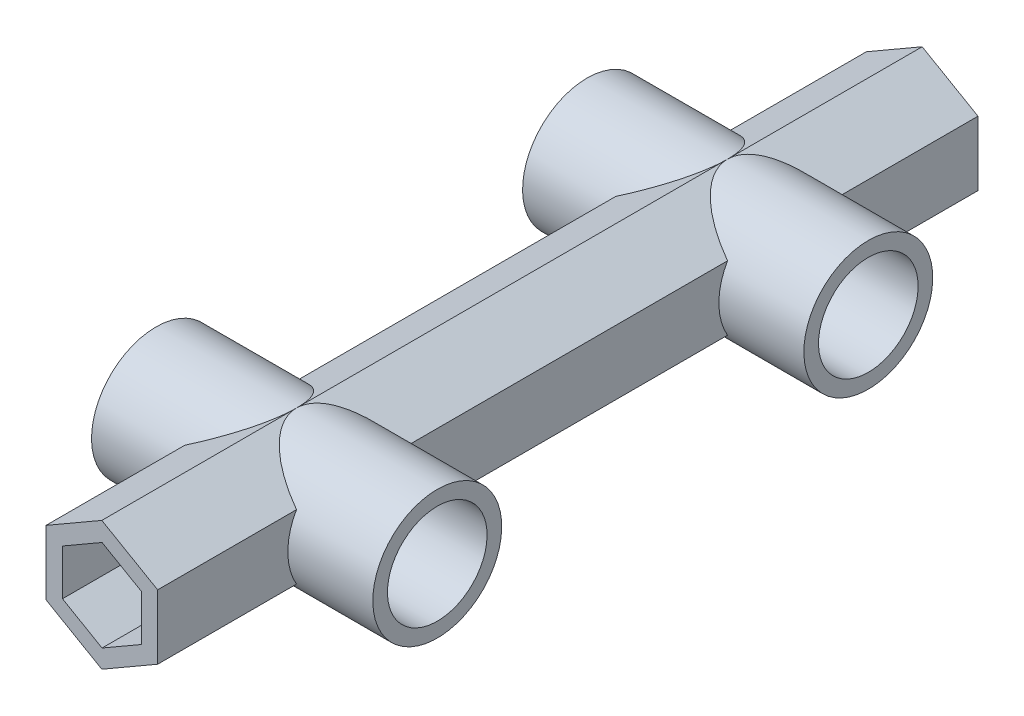
ISO-10303-21;
HEADER;
FILE_DESCRIPTION(('STEP AP214'),'2;1');
FILE_NAME('part.step','',(''),(''),'','','');
FILE_SCHEMA(('AUTOMOTIVE_DESIGN { 1 0 10303 214 1 1 1 1 }'));
ENDSEC;
DATA;
#1=APPLICATION_CONTEXT('core data for automotive mechanical design processes');
#2=APPLICATION_PROTOCOL_DEFINITION('international standard','automotive_design',2000,#1);
#3=PRODUCT_CONTEXT('',#1,'mechanical');
#4=PRODUCT('Part','Part','',(#3));
#5=PRODUCT_RELATED_PRODUCT_CATEGORY('part','',(#4));
#6=PRODUCT_DEFINITION_FORMATION('','',#4);
#7=PRODUCT_DEFINITION_CONTEXT('part definition',#1,'design');
#8=PRODUCT_DEFINITION('design','',#6,#7);
#9=PRODUCT_DEFINITION_SHAPE('','',#8);
#10=(LENGTH_UNIT() NAMED_UNIT(*) SI_UNIT(.MILLI.,.METRE.));
#11=(NAMED_UNIT(*) PLANE_ANGLE_UNIT() SI_UNIT($,.RADIAN.));
#12=(NAMED_UNIT(*) SI_UNIT($,.STERADIAN.) SOLID_ANGLE_UNIT());
#13=UNCERTAINTY_MEASURE_WITH_UNIT(LENGTH_MEASURE(1.E-05),#10,'distance_accuracy_value','');
#14=(GEOMETRIC_REPRESENTATION_CONTEXT(3) GLOBAL_UNCERTAINTY_ASSIGNED_CONTEXT((#13)) GLOBAL_UNIT_ASSIGNED_CONTEXT((#10,
#11,#12)) REPRESENTATION_CONTEXT('',''));
#15=CARTESIAN_POINT('',(0.,0.,0.));
#16=DIRECTION('',(0.,0.,1.));
#17=DIRECTION('',(1.,0.,0.));
#18=AXIS2_PLACEMENT_3D('',#15,#16,#17);
#19=CARTESIAN_POINT('',(-9.52627944162882,0.,70.));
#20=DIRECTION('',(1.,0.,0.));
#21=DIRECTION('',(0.,1.,0.));
#22=AXIS2_PLACEMENT_3D('',#19,#20,#21);
#23=PLANE('',#22);
#24=DIRECTION('',(0.,0.,-1.));
#25=VECTOR('',#24,1.);
#26=CARTESIAN_POINT('',(-9.52627944162882,5.5,70.));
#27=LINE('',#26,#25);
#28=CARTESIAN_POINT('',(-9.52627944162882,5.5,27.2537205583712));
#29=VERTEX_POINT('',#28);
#30=CARTESIAN_POINT('',(-9.52627944162882,5.5,-27.2537205583712));
#31=VERTEX_POINT('',#30);
#32=EDGE_CURVE('E262',#29,#31,#27,.T.);
#33=ORIENTED_EDGE('',*,*,#32,.T.);
#34=CARTESIAN_POINT('',(-9.52627944162882,0.,-36.78));
#35=DIRECTION('',(1.,0.,0.));
#36=DIRECTION('',(0.,1.,0.));
#37=AXIS2_PLACEMENT_3D('',#34,#35,#36);
#38=CIRCLE('',#37,11.);
#39=CARTESIAN_POINT('',(-9.52627944162882,-5.5,-27.2537205583712));
#40=VERTEX_POINT('',#39);
#41=EDGE_CURVE('E248',#31,#40,#38,.T.);
#42=ORIENTED_EDGE('',*,*,#41,.T.);
#43=DIRECTION('',(0.,0.,-1.));
#44=VECTOR('',#43,1.);
#45=CARTESIAN_POINT('',(-9.52627944162882,-5.5,70.));
#46=LINE('',#45,#44);
#47=CARTESIAN_POINT('',(-9.52627944162882,-5.5,27.2537205583712));
#48=VERTEX_POINT('',#47);
#49=EDGE_CURVE('E260',#48,#40,#46,.T.);
#50=ORIENTED_EDGE('',*,*,#49,.F.);
#51=CARTESIAN_POINT('',(-9.52627944162882,0.,36.78));
#52=DIRECTION('',(1.,0.,0.));
#53=DIRECTION('',(0.,1.,0.));
#54=AXIS2_PLACEMENT_3D('',#51,#52,#53);
#55=CIRCLE('',#54,11.);
#56=EDGE_CURVE('E277',#48,#29,#55,.T.);
#57=ORIENTED_EDGE('',*,*,#56,.T.);
#58=EDGE_LOOP('',(#33,#42,#50,#57));
#59=FACE_BOUND('',#58,.T.);
#60=ADVANCED_FACE('F62',(#59),#23,.F.);
#61=CARTESIAN_POINT('',(-4.76313972081441,8.25,70.));
#62=DIRECTION('',(0.5,-0.866025403784439,0.));
#63=DIRECTION('',(0.866025403784439,0.5,0.));
#64=AXIS2_PLACEMENT_3D('',#61,#62,#63);
#65=PLANE('',#64);
#66=DIRECTION('',(0.,0.,-1.));
#67=VECTOR('',#66,1.);
#68=CARTESIAN_POINT('',(0.,11.,70.));
#69=LINE('',#68,#67);
#70=CARTESIAN_POINT('',(0.,11.,36.78));
#71=VERTEX_POINT('',#70);
#72=CARTESIAN_POINT('',(0.,11.,-36.78));
#73=VERTEX_POINT('',#72);
#74=EDGE_CURVE('E360',#71,#73,#69,.T.);
#75=ORIENTED_EDGE('',*,*,#74,.T.);
#76=CARTESIAN_POINT('',(-19.0525588832577,0.,-36.78));
#77=DIRECTION('',(0.5,-0.866025403784439,0.));
#78=DIRECTION('',(0.866025403784439,0.5,0.));
#79=AXIS2_PLACEMENT_3D('',#76,#77,#78);
#80=ELLIPSE('',#79,22.,11.);
#81=EDGE_CURVE('E435',#73,#31,#80,.T.);
#82=ORIENTED_EDGE('',*,*,#81,.T.);
#83=ORIENTED_EDGE('',*,*,#32,.F.);
#84=CARTESIAN_POINT('',(-19.0525588832577,0.,36.78));
#85=DIRECTION('',(0.5,-0.866025403784439,0.));
#86=DIRECTION('',(0.866025403784439,0.5,0.));
#87=AXIS2_PLACEMENT_3D('',#84,#85,#86);
#88=ELLIPSE('',#87,22.,11.);
#89=EDGE_CURVE('E517',#29,#71,#88,.T.);
#90=ORIENTED_EDGE('',*,*,#89,.T.);
#91=EDGE_LOOP('',(#75,#82,#83,#90));
#92=FACE_BOUND('',#91,.T.);
#93=ADVANCED_FACE('F497',(#92),#65,.F.);
#94=CARTESIAN_POINT('',(4.76313972081441,8.25,70.));
#95=DIRECTION('',(-0.5,-0.866025403784439,0.));
#96=DIRECTION('',(0.866025403784439,-0.5,0.));
#97=AXIS2_PLACEMENT_3D('',#94,#95,#96);
#98=PLANE('',#97);
#99=DIRECTION('',(0.,0.,-1.));
#100=VECTOR('',#99,1.);
#101=CARTESIAN_POINT('',(9.52627944162882,5.5,70.));
#102=LINE('',#101,#100);
#103=CARTESIAN_POINT('',(9.52627944162882,5.5,27.2537205583712));
#104=VERTEX_POINT('',#103);
#105=CARTESIAN_POINT('',(9.52627944162882,5.5,-27.2537205583712));
#106=VERTEX_POINT('',#105);
#107=EDGE_CURVE('E365',#104,#106,#102,.T.);
#108=ORIENTED_EDGE('',*,*,#107,.T.);
#109=CARTESIAN_POINT('',(19.0525588832576,0.,-36.78));
#110=DIRECTION('',(-0.5,-0.866025403784439,0.));
#111=DIRECTION('',(0.866025403784439,-0.5,0.));
#112=AXIS2_PLACEMENT_3D('',#109,#110,#111);
#113=ELLIPSE('',#112,22.,11.);
#114=EDGE_CURVE('E413',#106,#73,#113,.T.);
#115=ORIENTED_EDGE('',*,*,#114,.T.);
#116=ORIENTED_EDGE('',*,*,#74,.F.);
#117=CARTESIAN_POINT('',(19.0525588832576,0.,36.78));
#118=DIRECTION('',(-0.5,-0.866025403784439,0.));
#119=DIRECTION('',(0.866025403784439,-0.5,0.));
#120=AXIS2_PLACEMENT_3D('',#117,#118,#119);
#121=ELLIPSE('',#120,22.,11.);
#122=EDGE_CURVE('E416',#71,#104,#121,.T.);
#123=ORIENTED_EDGE('',*,*,#122,.T.);
#124=EDGE_LOOP('',(#108,#115,#116,#123));
#125=FACE_BOUND('',#124,.T.);
#126=ADVANCED_FACE('F411',(#125),#98,.F.);
#127=CARTESIAN_POINT('',(9.52627944162882,0.,70.));
#128=DIRECTION('',(-1.,0.,0.));
#129=DIRECTION('',(0.,-1.,0.));
#130=AXIS2_PLACEMENT_3D('',#127,#128,#129);
#131=PLANE('',#130);
#132=DIRECTION('',(0.,0.,-1.));
#133=VECTOR('',#132,1.);
#134=CARTESIAN_POINT('',(9.52627944162883,-5.5,70.));
#135=LINE('',#134,#133);
#136=CARTESIAN_POINT('',(9.52627944162883,-5.5,27.2537205583712));
#137=VERTEX_POINT('',#136);
#138=CARTESIAN_POINT('',(9.52627944162883,-5.5,-27.2537205583712));
#139=VERTEX_POINT('',#138);
#140=EDGE_CURVE('E370',#137,#139,#135,.T.);
#141=ORIENTED_EDGE('',*,*,#140,.T.);
#142=CARTESIAN_POINT('',(9.52627944162882,0.,-36.78));
#143=DIRECTION('',(-1.,0.,0.));
#144=DIRECTION('',(0.,-1.,0.));
#145=AXIS2_PLACEMENT_3D('',#142,#143,#144);
#146=CIRCLE('',#145,11.);
#147=EDGE_CURVE('E423',#139,#106,#146,.T.);
#148=ORIENTED_EDGE('',*,*,#147,.T.);
#149=ORIENTED_EDGE('',*,*,#107,.F.);
#150=CARTESIAN_POINT('',(9.52627944162882,0.,36.78));
#151=DIRECTION('',(-1.,0.,0.));
#152=DIRECTION('',(0.,-1.,0.));
#153=AXIS2_PLACEMENT_3D('',#150,#151,#152);
#154=CIRCLE('',#153,11.);
#155=EDGE_CURVE('E421',#104,#137,#154,.T.);
#156=ORIENTED_EDGE('',*,*,#155,.T.);
#157=EDGE_LOOP('',(#141,#148,#149,#156));
#158=FACE_BOUND('',#157,.T.);
#159=ADVANCED_FACE('F420',(#158),#131,.F.);
#160=CARTESIAN_POINT('',(9.52627944162883,-5.5,70.));
#161=VERTEX_POINT('',#160);
#162=CARTESIAN_POINT('',(9.52627944162883,-5.5,46.3062794416288));
#163=VERTEX_POINT('',#162);
#164=EDGE_CURVE('E366',#161,#163,#135,.T.);
#165=ORIENTED_EDGE('',*,*,#164,.T.);
#166=CARTESIAN_POINT('',(9.52627944162882,5.5,46.3062794416288));
#167=VERTEX_POINT('',#166);
#168=EDGE_CURVE('E538',#163,#167,#154,.T.);
#169=ORIENTED_EDGE('',*,*,#168,.T.);
#170=CARTESIAN_POINT('',(9.52627944162882,5.5,70.));
#171=VERTEX_POINT('',#170);
#172=EDGE_CURVE('E361',#171,#167,#102,.T.);
#173=ORIENTED_EDGE('',*,*,#172,.F.);
#174=DIRECTION('',(0.,1.,0.));
#175=VECTOR('',#174,1.);
#176=CARTESIAN_POINT('',(9.52627944162882,0.,70.));
#177=LINE('',#176,#175);
#178=EDGE_CURVE('E323',#161,#171,#177,.T.);
#179=ORIENTED_EDGE('',*,*,#178,.F.);
#180=EDGE_LOOP('',(#165,#169,#173,#179));
#181=FACE_BOUND('',#180,.T.);
#182=ADVANCED_FACE('F708',(#181),#131,.F.);
#183=ORIENTED_EDGE('',*,*,#172,.T.);
#184=EDGE_CURVE('E528',#167,#71,#121,.T.);
#185=ORIENTED_EDGE('',*,*,#184,.T.);
#186=CARTESIAN_POINT('',(0.,11.,70.));
#187=VERTEX_POINT('',#186);
#188=EDGE_CURVE('E355',#187,#71,#69,.T.);
#189=ORIENTED_EDGE('',*,*,#188,.F.);
#190=DIRECTION('',(-0.866025403784439,0.5,0.));
#191=VECTOR('',#190,1.);
#192=CARTESIAN_POINT('',(4.76313972081441,8.25,70.));
#193=LINE('',#192,#191);
#194=EDGE_CURVE('E326',#171,#187,#193,.T.);
#195=ORIENTED_EDGE('',*,*,#194,.F.);
#196=EDGE_LOOP('',(#183,#185,#189,#195));
#197=FACE_BOUND('',#196,.T.);
#198=ADVANCED_FACE('F529',(#197),#98,.F.);
#199=ORIENTED_EDGE('',*,*,#188,.T.);
#200=CARTESIAN_POINT('',(-9.52627944162882,5.5,46.3062794416288));
#201=VERTEX_POINT('',#200);
#202=EDGE_CURVE('E525',#71,#201,#88,.T.);
#203=ORIENTED_EDGE('',*,*,#202,.T.);
#204=CARTESIAN_POINT('',(-9.52627944162882,5.5,70.));
#205=VERTEX_POINT('',#204);
#206=EDGE_CURVE('E290',#205,#201,#27,.T.);
#207=ORIENTED_EDGE('',*,*,#206,.F.);
#208=DIRECTION('',(-0.866025403784439,-0.5,0.));
#209=VECTOR('',#208,1.);
#210=CARTESIAN_POINT('',(-4.76313972081441,8.25,70.));
#211=LINE('',#210,#209);
#212=EDGE_CURVE('E309',#187,#205,#211,.T.);
#213=ORIENTED_EDGE('',*,*,#212,.F.);
#214=EDGE_LOOP('',(#199,#203,#207,#213));
#215=FACE_BOUND('',#214,.T.);
#216=ADVANCED_FACE('F503',(#215),#65,.F.);
#217=ORIENTED_EDGE('',*,*,#206,.T.);
#218=CARTESIAN_POINT('',(-9.52627944162882,-5.5,46.3062794416288));
#219=VERTEX_POINT('',#218);
#220=EDGE_CURVE('E255',#201,#219,#55,.T.);
#221=ORIENTED_EDGE('',*,*,#220,.T.);
#222=CARTESIAN_POINT('',(-9.52627944162882,-5.5,70.));
#223=VERTEX_POINT('',#222);
#224=EDGE_CURVE('E271',#223,#219,#46,.T.);
#225=ORIENTED_EDGE('',*,*,#224,.F.);
#226=DIRECTION('',(0.,-1.,0.));
#227=VECTOR('',#226,1.);
#228=CARTESIAN_POINT('',(-9.52627944162882,0.,70.));
#229=LINE('',#228,#227);
#230=EDGE_CURVE('E305',#205,#223,#229,.T.);
#231=ORIENTED_EDGE('',*,*,#230,.F.);
#232=EDGE_LOOP('',(#217,#221,#225,#231));
#233=FACE_BOUND('',#232,.T.);
#234=ADVANCED_FACE('F287',(#233),#23,.F.);
#235=CARTESIAN_POINT('',(-4.76313972081441,-8.25,70.));
#236=DIRECTION('',(0.5,0.866025403784439,0.));
#237=DIRECTION('',(-0.866025403784439,0.5,0.));
#238=AXIS2_PLACEMENT_3D('',#235,#236,#237);
#239=PLANE('',#238);
#240=ORIENTED_EDGE('',*,*,#224,.T.);
#241=CARTESIAN_POINT('',(-19.0525588832576,0.,36.78));
#242=DIRECTION('',(0.5,0.866025403784439,0.));
#243=DIRECTION('',(0.866025403784439,-0.5,0.));
#244=AXIS2_PLACEMENT_3D('',#241,#242,#243);
#245=ELLIPSE('',#244,22.,11.);
#246=CARTESIAN_POINT('',(0.,-11.,36.78));
#247=VERTEX_POINT('',#246);
#248=EDGE_CURVE('E297',#219,#247,#245,.T.);
#249=ORIENTED_EDGE('',*,*,#248,.T.);
#250=DIRECTION('',(0.,0.,-1.));
#251=VECTOR('',#250,1.);
#252=CARTESIAN_POINT('',(0.,-11.,70.));
#253=LINE('',#252,#251);
#254=CARTESIAN_POINT('',(0.,-11.,70.));
#255=VERTEX_POINT('',#254);
#256=EDGE_CURVE('E278',#255,#247,#253,.T.);
#257=ORIENTED_EDGE('',*,*,#256,.F.);
#258=DIRECTION('',(0.866025403784439,-0.5,0.));
#259=VECTOR('',#258,1.);
#260=CARTESIAN_POINT('',(-4.76313972081441,-8.25,70.));
#261=LINE('',#260,#259);
#262=EDGE_CURVE('E298',#223,#255,#261,.T.);
#263=ORIENTED_EDGE('',*,*,#262,.F.);
#264=EDGE_LOOP('',(#240,#249,#257,#263));
#265=FACE_BOUND('',#264,.T.);
#266=ADVANCED_FACE('F295',(#265),#239,.F.);
#267=CARTESIAN_POINT('',(4.76313972081441,-8.25,70.));
#268=DIRECTION('',(-0.5,0.866025403784439,0.));
#269=DIRECTION('',(-0.866025403784439,-0.5,0.));
#270=AXIS2_PLACEMENT_3D('',#267,#268,#269);
#271=PLANE('',#270);
#272=ORIENTED_EDGE('',*,*,#256,.T.);
#273=CARTESIAN_POINT('',(19.0525588832577,0.,36.78));
#274=DIRECTION('',(-0.5,0.866025403784439,0.));
#275=DIRECTION('',(0.866025403784439,0.5,0.));
#276=AXIS2_PLACEMENT_3D('',#273,#274,#275);
#277=ELLIPSE('',#276,22.,11.);
#278=EDGE_CURVE('E541',#247,#163,#277,.T.);
#279=ORIENTED_EDGE('',*,*,#278,.T.);
#280=ORIENTED_EDGE('',*,*,#164,.F.);
#281=DIRECTION('',(0.866025403784439,0.5,0.));
#282=VECTOR('',#281,1.);
#283=CARTESIAN_POINT('',(4.76313972081441,-8.25,70.));
#284=LINE('',#283,#282);
#285=EDGE_CURVE('E304',#255,#161,#284,.T.);
#286=ORIENTED_EDGE('',*,*,#285,.F.);
#287=EDGE_LOOP('',(#272,#279,#280,#286));
#288=FACE_BOUND('',#287,.T.);
#289=ADVANCED_FACE('F699',(#288),#271,.F.);
#290=CARTESIAN_POINT('',(0.,0.,70.));
#291=DIRECTION('',(0.,0.,1.));
#292=DIRECTION('',(1.,0.,0.));
#293=AXIS2_PLACEMENT_3D('',#290,#291,#292);
#294=PLANE('',#293);
#295=DIRECTION('',(0.866025403784439,-0.5,0.));
#296=VECTOR('',#295,1.);
#297=CARTESIAN_POINT('',(-6.71421235470221,-3.94078579481641,70.));
#298=LINE('',#297,#296);
#299=CARTESIAN_POINT('',(-6.71421235470221,-3.94078579481641,70.));
#300=VERTEX_POINT('',#299);
#301=CARTESIAN_POINT('',(0.0407857948164104,-7.84078579481641,70.));
#302=VERTEX_POINT('',#301);
#303=EDGE_CURVE('E578',#300,#302,#298,.T.);
#304=ORIENTED_EDGE('',*,*,#303,.F.);
#305=DIRECTION('',(0.,-1.,0.));
#306=VECTOR('',#305,1.);
#307=CARTESIAN_POINT('',(-6.71421235470221,3.85921420518359,70.));
#308=LINE('',#307,#306);
#309=CARTESIAN_POINT('',(-6.71421235470221,3.85921420518359,70.));
#310=VERTEX_POINT('',#309);
#311=EDGE_CURVE('E599',#310,#300,#308,.T.);
#312=ORIENTED_EDGE('',*,*,#311,.F.);
#313=DIRECTION('',(-0.866025403784439,-0.5,0.));
#314=VECTOR('',#313,1.);
#315=CARTESIAN_POINT('',(0.0407857948164078,7.75921420518359,70.));
#316=LINE('',#315,#314);
#317=CARTESIAN_POINT('',(0.0407857948164078,7.75921420518359,70.));
#318=VERTEX_POINT('',#317);
#319=EDGE_CURVE('E633',#318,#310,#316,.T.);
#320=ORIENTED_EDGE('',*,*,#319,.F.);
#321=DIRECTION('',(-0.866025403784439,0.5,0.));
#322=VECTOR('',#321,1.);
#323=CARTESIAN_POINT('',(6.79578394433503,3.85921420518359,70.));
#324=LINE('',#323,#322);
#325=CARTESIAN_POINT('',(6.79578394433503,3.85921420518359,70.));
#326=VERTEX_POINT('',#325);
#327=EDGE_CURVE('E629',#326,#318,#324,.T.);
#328=ORIENTED_EDGE('',*,*,#327,.F.);
#329=DIRECTION('',(0.,1.,0.));
#330=VECTOR('',#329,1.);
#331=CARTESIAN_POINT('',(6.79578394433503,-3.94078579481641,70.));
#332=LINE('',#331,#330);
#333=CARTESIAN_POINT('',(6.79578394433503,-3.94078579481641,70.));
#334=VERTEX_POINT('',#333);
#335=EDGE_CURVE('E625',#334,#326,#332,.T.);
#336=ORIENTED_EDGE('',*,*,#335,.F.);
#337=DIRECTION('',(0.866025403784439,0.5,0.));
#338=VECTOR('',#337,1.);
#339=CARTESIAN_POINT('',(0.0407857948164104,-7.84078579481641,70.));
#340=LINE('',#339,#338);
#341=EDGE_CURVE('E621',#302,#334,#340,.T.);
#342=ORIENTED_EDGE('',*,*,#341,.F.);
#343=EDGE_LOOP('',(#304,#312,#320,#328,#336,#342));
#344=FACE_BOUND('',#343,.T.);
#345=ORIENTED_EDGE('',*,*,#230,.T.);
#346=ORIENTED_EDGE('',*,*,#262,.T.);
#347=ORIENTED_EDGE('',*,*,#285,.T.);
#348=ORIENTED_EDGE('',*,*,#178,.T.);
#349=ORIENTED_EDGE('',*,*,#194,.T.);
#350=ORIENTED_EDGE('',*,*,#212,.T.);
#351=EDGE_LOOP('',(#345,#346,#347,#348,#349,#350));
#352=FACE_BOUND('',#351,.T.);
#353=ADVANCED_FACE('F307',(#344,#352),#294,.T.);
#354=CARTESIAN_POINT('',(-6.71421235470221,-3.94078579481641,55.));
#355=DIRECTION('',(-0.5,-0.866025403784439,0.));
#356=DIRECTION('',(0.866025403784439,-0.5,0.));
#357=AXIS2_PLACEMENT_3D('',#354,#355,#356);
#358=PLANE('',#357);
#359=ORIENTED_EDGE('',*,*,#303,.T.);
#360=DIRECTION('',(0.,0.,1.));
#361=VECTOR('',#360,1.);
#362=CARTESIAN_POINT('',(0.0407857948164104,-7.84078579481641,55.));
#363=LINE('',#362,#361);
#364=CARTESIAN_POINT('',(0.0407857948164104,-7.84078579481641,55.));
#365=VERTEX_POINT('',#364);
#366=EDGE_CURVE('E318',#365,#302,#363,.T.);
#367=ORIENTED_EDGE('',*,*,#366,.F.);
#368=DIRECTION('',(0.866025403784439,-0.5,0.));
#369=VECTOR('',#368,1.);
#370=CARTESIAN_POINT('',(-6.71421235470221,-3.94078579481641,55.));
#371=LINE('',#370,#369);
#372=CARTESIAN_POINT('',(-6.71421235470221,-3.94078579481641,55.));
#373=VERTEX_POINT('',#372);
#374=EDGE_CURVE('E594',#373,#365,#371,.T.);
#375=ORIENTED_EDGE('',*,*,#374,.F.);
#376=DIRECTION('',(0.,0.,1.));
#377=VECTOR('',#376,1.);
#378=CARTESIAN_POINT('',(-6.71421235470221,-3.94078579481641,55.));
#379=LINE('',#378,#377);
#380=EDGE_CURVE('E337',#373,#300,#379,.T.);
#381=ORIENTED_EDGE('',*,*,#380,.T.);
#382=EDGE_LOOP('',(#359,#367,#375,#381));
#383=FACE_BOUND('',#382,.T.);
#384=ADVANCED_FACE('F676',(#383),#358,.F.);
#385=CARTESIAN_POINT('',(-6.71421235470221,3.85921420518359,55.));
#386=DIRECTION('',(-1.,0.,0.));
#387=DIRECTION('',(0.,-1.,0.));
#388=AXIS2_PLACEMENT_3D('',#385,#386,#387);
#389=PLANE('',#388);
#390=ORIENTED_EDGE('',*,*,#311,.T.);
#391=ORIENTED_EDGE('',*,*,#380,.F.);
#392=DIRECTION('',(0.,-1.,0.));
#393=VECTOR('',#392,1.);
#394=CARTESIAN_POINT('',(-6.71421235470221,3.85921420518359,55.));
#395=LINE('',#394,#393);
#396=CARTESIAN_POINT('',(-6.71421235470221,3.85921420518359,55.));
#397=VERTEX_POINT('',#396);
#398=EDGE_CURVE('E615',#397,#373,#395,.T.);
#399=ORIENTED_EDGE('',*,*,#398,.F.);
#400=DIRECTION('',(0.,0.,1.));
#401=VECTOR('',#400,1.);
#402=CARTESIAN_POINT('',(-6.71421235470221,3.85921420518359,55.));
#403=LINE('',#402,#401);
#404=EDGE_CURVE('E642',#397,#310,#403,.T.);
#405=ORIENTED_EDGE('',*,*,#404,.T.);
#406=EDGE_LOOP('',(#390,#391,#399,#405));
#407=FACE_BOUND('',#406,.T.);
#408=ADVANCED_FACE('F678',(#407),#389,.F.);
#409=CARTESIAN_POINT('',(0.0407857948164078,7.75921420518359,55.));
#410=DIRECTION('',(-0.5,0.866025403784439,0.));
#411=DIRECTION('',(-0.866025403784439,-0.5,0.));
#412=AXIS2_PLACEMENT_3D('',#409,#410,#411);
#413=PLANE('',#412);
#414=ORIENTED_EDGE('',*,*,#319,.T.);
#415=ORIENTED_EDGE('',*,*,#404,.F.);
#416=DIRECTION('',(-0.866025403784439,-0.5,0.));
#417=VECTOR('',#416,1.);
#418=CARTESIAN_POINT('',(0.0407857948164078,7.75921420518359,55.));
#419=LINE('',#418,#417);
#420=CARTESIAN_POINT('',(0.0407857948164078,7.75921420518359,55.));
#421=VERTEX_POINT('',#420);
#422=EDGE_CURVE('E611',#421,#397,#419,.T.);
#423=ORIENTED_EDGE('',*,*,#422,.F.);
#424=DIRECTION('',(0.,0.,1.));
#425=VECTOR('',#424,1.);
#426=CARTESIAN_POINT('',(0.0407857948164078,7.75921420518359,55.));
#427=LINE('',#426,#425);
#428=EDGE_CURVE('E645',#421,#318,#427,.T.);
#429=ORIENTED_EDGE('',*,*,#428,.T.);
#430=EDGE_LOOP('',(#414,#415,#423,#429));
#431=FACE_BOUND('',#430,.T.);
#432=ADVANCED_FACE('F680',(#431),#413,.F.);
#433=CARTESIAN_POINT('',(6.79578394433503,3.85921420518359,55.));
#434=DIRECTION('',(0.5,0.866025403784439,0.));
#435=DIRECTION('',(-0.866025403784439,0.5,0.));
#436=AXIS2_PLACEMENT_3D('',#433,#434,#435);
#437=PLANE('',#436);
#438=ORIENTED_EDGE('',*,*,#327,.T.);
#439=ORIENTED_EDGE('',*,*,#428,.F.);
#440=DIRECTION('',(-0.866025403784439,0.5,0.));
#441=VECTOR('',#440,1.);
#442=CARTESIAN_POINT('',(6.79578394433503,3.85921420518359,55.));
#443=LINE('',#442,#441);
#444=CARTESIAN_POINT('',(6.79578394433503,3.85921420518359,55.));
#445=VERTEX_POINT('',#444);
#446=EDGE_CURVE('E607',#445,#421,#443,.T.);
#447=ORIENTED_EDGE('',*,*,#446,.F.);
#448=DIRECTION('',(0.,0.,1.));
#449=VECTOR('',#448,1.);
#450=CARTESIAN_POINT('',(6.79578394433503,3.85921420518359,55.));
#451=LINE('',#450,#449);
#452=EDGE_CURVE('E648',#445,#326,#451,.T.);
#453=ORIENTED_EDGE('',*,*,#452,.T.);
#454=EDGE_LOOP('',(#438,#439,#447,#453));
#455=FACE_BOUND('',#454,.T.);
#456=ADVANCED_FACE('F671',(#455),#437,.F.);
#457=CARTESIAN_POINT('',(6.79578394433503,-3.94078579481641,55.));
#458=DIRECTION('',(1.,0.,0.));
#459=DIRECTION('',(0.,1.,0.));
#460=AXIS2_PLACEMENT_3D('',#457,#458,#459);
#461=PLANE('',#460);
#462=ORIENTED_EDGE('',*,*,#335,.T.);
#463=ORIENTED_EDGE('',*,*,#452,.F.);
#464=DIRECTION('',(0.,1.,0.));
#465=VECTOR('',#464,1.);
#466=CARTESIAN_POINT('',(6.79578394433503,-3.94078579481641,55.));
#467=LINE('',#466,#465);
#468=CARTESIAN_POINT('',(6.79578394433503,-3.94078579481641,55.));
#469=VERTEX_POINT('',#468);
#470=EDGE_CURVE('E603',#469,#445,#467,.T.);
#471=ORIENTED_EDGE('',*,*,#470,.F.);
#472=DIRECTION('',(0.,0.,1.));
#473=VECTOR('',#472,1.);
#474=CARTESIAN_POINT('',(6.79578394433503,-3.94078579481641,55.));
#475=LINE('',#474,#473);
#476=EDGE_CURVE('E650',#469,#334,#475,.T.);
#477=ORIENTED_EDGE('',*,*,#476,.T.);
#478=EDGE_LOOP('',(#462,#463,#471,#477));
#479=FACE_BOUND('',#478,.T.);
#480=ADVANCED_FACE('F668',(#479),#461,.F.);
#481=CARTESIAN_POINT('',(0.0407857948164104,-7.84078579481641,55.));
#482=DIRECTION('',(0.5,-0.866025403784438,0.));
#483=DIRECTION('',(0.866025403784439,0.5,0.));
#484=AXIS2_PLACEMENT_3D('',#481,#482,#483);
#485=PLANE('',#484);
#486=ORIENTED_EDGE('',*,*,#341,.T.);
#487=ORIENTED_EDGE('',*,*,#476,.F.);
#488=DIRECTION('',(0.866025403784439,0.5,0.));
#489=VECTOR('',#488,1.);
#490=CARTESIAN_POINT('',(0.0407857948164104,-7.84078579481641,55.));
#491=LINE('',#490,#489);
#492=EDGE_CURVE('E598',#365,#469,#491,.T.);
#493=ORIENTED_EDGE('',*,*,#492,.F.);
#494=ORIENTED_EDGE('',*,*,#366,.T.);
#495=EDGE_LOOP('',(#486,#487,#493,#494));
#496=FACE_BOUND('',#495,.T.);
#497=ADVANCED_FACE('F659',(#496),#485,.F.);
#498=CARTESIAN_POINT('',(0.,0.,55.));
#499=DIRECTION('',(0.,0.,1.));
#500=DIRECTION('',(1.,0.,0.));
#501=AXIS2_PLACEMENT_3D('',#498,#499,#500);
#502=PLANE('',#501);
#503=ORIENTED_EDGE('',*,*,#374,.T.);
#504=ORIENTED_EDGE('',*,*,#492,.T.);
#505=ORIENTED_EDGE('',*,*,#470,.T.);
#506=ORIENTED_EDGE('',*,*,#446,.T.);
#507=ORIENTED_EDGE('',*,*,#422,.T.);
#508=ORIENTED_EDGE('',*,*,#398,.T.);
#509=EDGE_LOOP('',(#503,#504,#505,#506,#507,#508));
#510=FACE_BOUND('',#509,.T.);
#511=ADVANCED_FACE('F674',(#510),#502,.T.);
#512=CARTESIAN_POINT('',(-23.9737205583712,0.,36.78));
#513=DIRECTION('',(1.,0.,0.));
#514=DIRECTION('',(0.,1.,0.));
#515=AXIS2_PLACEMENT_3D('',#512,#513,#514);
#516=CYLINDRICAL_SURFACE('',#515,11.);
#517=CARTESIAN_POINT('',(-23.9737205583712,0.,36.78));
#518=DIRECTION('',(1.,0.,0.));
#519=DIRECTION('',(0.,1.,0.));
#520=AXIS2_PLACEMENT_3D('',#517,#518,#519);
#521=CIRCLE('',#520,11.);
#522=CARTESIAN_POINT('',(-23.9737205583712,11.,36.78));
#523=VERTEX_POINT('',#522);
#524=EDGE_CURVE('E1055',#523,#523,#521,.T.);
#525=ORIENTED_EDGE('',*,*,#524,.T.);
#526=EDGE_LOOP('',(#525));
#527=FACE_BOUND('',#526,.T.);
#528=ORIENTED_EDGE('',*,*,#248,.F.);
#529=ORIENTED_EDGE('',*,*,#220,.F.);
#530=ORIENTED_EDGE('',*,*,#202,.F.);
#531=ORIENTED_EDGE('',*,*,#89,.F.);
#532=ORIENTED_EDGE('',*,*,#56,.F.);
#533=EDGE_CURVE('E269',#247,#48,#245,.T.);
#534=ORIENTED_EDGE('',*,*,#533,.F.);
#535=EDGE_LOOP('',(#528,#529,#530,#531,#532,#534));
#536=FACE_BOUND('',#535,.T.);
#537=ADVANCED_FACE('F725',(#527,#536),#516,.T.);
#538=CARTESIAN_POINT('',(-23.9737205583712,0.,36.78));
#539=DIRECTION('',(1.,0.,0.));
#540=DIRECTION('',(0.,1.,0.));
#541=AXIS2_PLACEMENT_3D('',#538,#539,#540);
#542=PLANE('',#541);
#543=CARTESIAN_POINT('',(-23.9737205583712,0.,36.78));
#544=DIRECTION('',(1.,0.,0.));
#545=DIRECTION('',(0.,1.,0.));
#546=AXIS2_PLACEMENT_3D('',#543,#544,#545);
#547=CIRCLE('',#546,8.5);
#548=CARTESIAN_POINT('',(-23.9737205583712,8.49999999999999,36.78));
#549=VERTEX_POINT('',#548);
#550=EDGE_CURVE('E1049',#549,#549,#547,.T.);
#551=ORIENTED_EDGE('',*,*,#550,.T.);
#552=EDGE_LOOP('',(#551));
#553=FACE_BOUND('',#552,.T.);
#554=ORIENTED_EDGE('',*,*,#524,.F.);
#555=EDGE_LOOP('',(#554));
#556=FACE_BOUND('',#555,.T.);
#557=ADVANCED_FACE('F726',(#553,#556),#542,.F.);
#558=CARTESIAN_POINT('',(0.,-11.,-36.78));
#559=VERTEX_POINT('',#558);
#560=EDGE_CURVE('E377',#247,#559,#253,.T.);
#561=ORIENTED_EDGE('',*,*,#560,.T.);
#562=CARTESIAN_POINT('',(19.0525588832577,0.,-36.78));
#563=DIRECTION('',(-0.5,0.866025403784439,0.));
#564=DIRECTION('',(0.866025403784439,0.5,0.));
#565=AXIS2_PLACEMENT_3D('',#562,#563,#564);
#566=ELLIPSE('',#565,22.,11.);
#567=EDGE_CURVE('E78',#559,#139,#566,.T.);
#568=ORIENTED_EDGE('',*,*,#567,.T.);
#569=ORIENTED_EDGE('',*,*,#140,.F.);
#570=EDGE_CURVE('E533',#137,#247,#277,.T.);
#571=ORIENTED_EDGE('',*,*,#570,.T.);
#572=EDGE_LOOP('',(#561,#568,#569,#571));
#573=FACE_BOUND('',#572,.T.);
#574=ADVANCED_FACE('F711',(#573),#271,.F.);
#575=ORIENTED_EDGE('',*,*,#49,.T.);
#576=CARTESIAN_POINT('',(-19.0525588832576,0.,-36.78));
#577=DIRECTION('',(0.5,0.866025403784439,0.));
#578=DIRECTION('',(0.866025403784439,-0.5,0.));
#579=AXIS2_PLACEMENT_3D('',#576,#577,#578);
#580=ELLIPSE('',#579,22.,11.);
#581=EDGE_CURVE('E66',#40,#559,#580,.T.);
#582=ORIENTED_EDGE('',*,*,#581,.T.);
#583=ORIENTED_EDGE('',*,*,#560,.F.);
#584=ORIENTED_EDGE('',*,*,#533,.T.);
#585=EDGE_LOOP('',(#575,#582,#583,#584));
#586=FACE_BOUND('',#585,.T.);
#587=ADVANCED_FACE('F267',(#586),#239,.F.);
#588=CARTESIAN_POINT('',(24.0262794416288,0.,36.78));
#589=DIRECTION('',(1.,0.,0.));
#590=DIRECTION('',(0.,1.,0.));
#591=AXIS2_PLACEMENT_3D('',#588,#589,#590);
#592=CIRCLE('',#591,11.);
#593=CARTESIAN_POINT('',(24.0262794416288,11.,36.78));
#594=VERTEX_POINT('',#593);
#595=EDGE_CURVE('E1043',#594,#594,#592,.T.);
#596=ORIENTED_EDGE('',*,*,#595,.F.);
#597=EDGE_LOOP('',(#596));
#598=FACE_BOUND('',#597,.T.);
#599=ORIENTED_EDGE('',*,*,#122,.F.);
#600=ORIENTED_EDGE('',*,*,#184,.F.);
#601=ORIENTED_EDGE('',*,*,#168,.F.);
#602=ORIENTED_EDGE('',*,*,#278,.F.);
#603=ORIENTED_EDGE('',*,*,#570,.F.);
#604=ORIENTED_EDGE('',*,*,#155,.F.);
#605=EDGE_LOOP('',(#599,#600,#601,#602,#603,#604));
#606=FACE_BOUND('',#605,.T.);
#607=ADVANCED_FACE('F717',(#598,#606),#516,.T.);
#608=CARTESIAN_POINT('',(-23.9737205583712,0.,36.78));
#609=DIRECTION('',(1.,0.,0.));
#610=DIRECTION('',(0.,1.,0.));
#611=AXIS2_PLACEMENT_3D('',#608,#609,#610);
#612=CYLINDRICAL_SURFACE('',#611,8.5);
#613=CARTESIAN_POINT('',(24.0262794416288,0.,36.78));
#614=DIRECTION('',(1.,0.,0.));
#615=DIRECTION('',(0.,1.,0.));
#616=AXIS2_PLACEMENT_3D('',#613,#614,#615);
#617=CIRCLE('',#616,8.5);
#618=CARTESIAN_POINT('',(24.0262794416288,8.50000000000001,36.78));
#619=VERTEX_POINT('',#618);
#620=EDGE_CURVE('E428',#619,#619,#617,.T.);
#621=ORIENTED_EDGE('',*,*,#620,.T.);
#622=EDGE_LOOP('',(#621));
#623=FACE_BOUND('',#622,.T.);
#624=ORIENTED_EDGE('',*,*,#550,.F.);
#625=EDGE_LOOP('',(#624));
#626=FACE_BOUND('',#625,.T.);
#627=ADVANCED_FACE('F722',(#623,#626),#612,.F.);
#628=CARTESIAN_POINT('',(24.0262794416288,0.,36.78));
#629=DIRECTION('',(1.,0.,0.));
#630=DIRECTION('',(0.,1.,0.));
#631=AXIS2_PLACEMENT_3D('',#628,#629,#630);
#632=PLANE('',#631);
#633=ORIENTED_EDGE('',*,*,#595,.T.);
#634=EDGE_LOOP('',(#633));
#635=FACE_BOUND('',#634,.T.);
#636=ORIENTED_EDGE('',*,*,#620,.F.);
#637=EDGE_LOOP('',(#636));
#638=FACE_BOUND('',#637,.T.);
#639=ADVANCED_FACE('F778',(#635,#638),#632,.T.);
#640=CARTESIAN_POINT('',(-23.9737205583712,0.,-36.78));
#641=DIRECTION('',(1.,0.,0.));
#642=DIRECTION('',(0.,1.,0.));
#643=AXIS2_PLACEMENT_3D('',#640,#641,#642);
#644=CYLINDRICAL_SURFACE('',#643,11.);
#645=CARTESIAN_POINT('',(-23.9737205583712,0.,-36.78));
#646=DIRECTION('',(1.,0.,0.));
#647=DIRECTION('',(0.,1.,0.));
#648=AXIS2_PLACEMENT_3D('',#645,#646,#647);
#649=CIRCLE('',#648,11.);
#650=CARTESIAN_POINT('',(-23.9737205583712,11.,-36.78));
#651=VERTEX_POINT('',#650);
#652=EDGE_CURVE('E445',#651,#651,#649,.T.);
#653=ORIENTED_EDGE('',*,*,#652,.T.);
#654=EDGE_LOOP('',(#653));
#655=FACE_BOUND('',#654,.T.);
#656=ORIENTED_EDGE('',*,*,#81,.F.);
#657=CARTESIAN_POINT('',(-9.52627944162882,5.5,-46.3062794416288));
#658=VERTEX_POINT('',#657);
#659=EDGE_CURVE('E264',#658,#73,#80,.T.);
#660=ORIENTED_EDGE('',*,*,#659,.F.);
#661=CARTESIAN_POINT('',(-9.52627944162882,-5.5,-46.3062794416288));
#662=VERTEX_POINT('',#661);
#663=EDGE_CURVE('E85',#662,#658,#38,.T.);
#664=ORIENTED_EDGE('',*,*,#663,.F.);
#665=EDGE_CURVE('E12',#559,#662,#580,.T.);
#666=ORIENTED_EDGE('',*,*,#665,.F.);
#667=ORIENTED_EDGE('',*,*,#581,.F.);
#668=ORIENTED_EDGE('',*,*,#41,.F.);
#669=EDGE_LOOP('',(#656,#660,#664,#666,#667,#668));
#670=FACE_BOUND('',#669,.T.);
#671=ADVANCED_FACE('F247',(#655,#670),#644,.T.);
#672=CARTESIAN_POINT('',(-23.9737205583712,0.,-36.78));
#673=DIRECTION('',(1.,0.,0.));
#674=DIRECTION('',(0.,1.,0.));
#675=AXIS2_PLACEMENT_3D('',#672,#673,#674);
#676=PLANE('',#675);
#677=CARTESIAN_POINT('',(-23.9737205583712,0.,-36.78));
#678=DIRECTION('',(1.,0.,0.));
#679=DIRECTION('',(0.,1.,0.));
#680=AXIS2_PLACEMENT_3D('',#677,#678,#679);
#681=CIRCLE('',#680,9.);
#682=CARTESIAN_POINT('',(-23.9737205583712,8.99999999999999,-36.78));
#683=VERTEX_POINT('',#682);
#684=EDGE_CURVE('E457',#683,#683,#681,.T.);
#685=ORIENTED_EDGE('',*,*,#684,.T.);
#686=EDGE_LOOP('',(#685));
#687=FACE_BOUND('',#686,.T.);
#688=ORIENTED_EDGE('',*,*,#652,.F.);
#689=EDGE_LOOP('',(#688));
#690=FACE_BOUND('',#689,.T.);
#691=ADVANCED_FACE('F466',(#687,#690),#676,.F.);
#692=CARTESIAN_POINT('',(0.,0.,-55.));
#693=DIRECTION('',(0.,0.,-1.));
#694=DIRECTION('',(-1.,0.,0.));
#695=AXIS2_PLACEMENT_3D('',#692,#693,#694);
#696=PLANE('',#695);
#697=DIRECTION('',(-0.866025403784439,-0.5,0.));
#698=VECTOR('',#697,1.);
#699=CARTESIAN_POINT('',(6.75499814951862,-3.92039289740821,-55.));
#700=LINE('',#699,#698);
#701=CARTESIAN_POINT('',(6.75499814951862,-3.92039289740821,-55.));
#702=VERTEX_POINT('',#701);
#703=CARTESIAN_POINT('',(0.,-7.82039289740821,-55.));
#704=VERTEX_POINT('',#703);
#705=EDGE_CURVE('E574',#702,#704,#700,.T.);
#706=ORIENTED_EDGE('',*,*,#705,.T.);
#707=DIRECTION('',(-0.866025403784439,0.5,0.));
#708=VECTOR('',#707,1.);
#709=CARTESIAN_POINT('',(0.,-7.82039289740821,-55.));
#710=LINE('',#709,#708);
#711=CARTESIAN_POINT('',(-6.75499814951862,-3.92039289740821,-55.));
#712=VERTEX_POINT('',#711);
#713=EDGE_CURVE('E1096',#704,#712,#710,.T.);
#714=ORIENTED_EDGE('',*,*,#713,.T.);
#715=DIRECTION('',(0.,1.,0.));
#716=VECTOR('',#715,1.);
#717=CARTESIAN_POINT('',(-6.75499814951862,-3.92039289740821,-55.));
#718=LINE('',#717,#716);
#719=CARTESIAN_POINT('',(-6.75499814951862,3.8796071025918,-55.));
#720=VERTEX_POINT('',#719);
#721=EDGE_CURVE('E1091',#712,#720,#718,.T.);
#722=ORIENTED_EDGE('',*,*,#721,.T.);
#723=DIRECTION('',(0.866025403784439,0.5,0.));
#724=VECTOR('',#723,1.);
#725=CARTESIAN_POINT('',(-6.75499814951862,3.8796071025918,-55.));
#726=LINE('',#725,#724);
#727=CARTESIAN_POINT('',(0.,7.77960710259179,-55.));
#728=VERTEX_POINT('',#727);
#729=EDGE_CURVE('E1095',#720,#728,#726,.T.);
#730=ORIENTED_EDGE('',*,*,#729,.T.);
#731=DIRECTION('',(0.866025403784439,-0.5,0.));
#732=VECTOR('',#731,1.);
#733=CARTESIAN_POINT('',(0.,7.77960710259179,-55.));
#734=LINE('',#733,#732);
#735=CARTESIAN_POINT('',(6.75499814951862,3.87960710259179,-55.));
#736=VERTEX_POINT('',#735);
#737=EDGE_CURVE('E1106',#728,#736,#734,.T.);
#738=ORIENTED_EDGE('',*,*,#737,.T.);
#739=DIRECTION('',(0.,-1.,0.));
#740=VECTOR('',#739,1.);
#741=CARTESIAN_POINT('',(6.75499814951862,3.87960710259179,-55.));
#742=LINE('',#741,#740);
#743=EDGE_CURVE('E556',#736,#702,#742,.T.);
#744=ORIENTED_EDGE('',*,*,#743,.T.);
#745=EDGE_LOOP('',(#706,#714,#722,#730,#738,#744));
#746=FACE_BOUND('',#745,.T.);
#747=ADVANCED_FACE('F789',(#746),#696,.T.);
#748=CARTESIAN_POINT('',(-6.75499814951862,-3.92039289740821,-55.));
#749=DIRECTION('',(-1.,0.,0.));
#750=DIRECTION('',(0.,-1.,0.));
#751=AXIS2_PLACEMENT_3D('',#748,#749,#750);
#752=PLANE('',#751);
#753=DIRECTION('',(0.,1.,0.));
#754=VECTOR('',#753,1.);
#755=CARTESIAN_POINT('',(-6.75499814951862,-3.92039289740821,-70.));
#756=LINE('',#755,#754);
#757=CARTESIAN_POINT('',(-6.75499814951862,-3.92039289740821,-70.));
#758=VERTEX_POINT('',#757);
#759=CARTESIAN_POINT('',(-6.75499814951862,3.8796071025918,-70.));
#760=VERTEX_POINT('',#759);
#761=EDGE_CURVE('E553',#758,#760,#756,.T.);
#762=ORIENTED_EDGE('',*,*,#761,.T.);
#763=DIRECTION('',(0.,0.,-1.));
#764=VECTOR('',#763,1.);
#765=CARTESIAN_POINT('',(-6.75499814951862,3.8796071025918,-55.));
#766=LINE('',#765,#764);
#767=EDGE_CURVE('E585',#720,#760,#766,.T.);
#768=ORIENTED_EDGE('',*,*,#767,.F.);
#769=ORIENTED_EDGE('',*,*,#721,.F.);
#770=DIRECTION('',(0.,0.,-1.));
#771=VECTOR('',#770,1.);
#772=CARTESIAN_POINT('',(-6.75499814951862,-3.92039289740821,-55.));
#773=LINE('',#772,#771);
#774=EDGE_CURVE('E588',#712,#758,#773,.T.);
#775=ORIENTED_EDGE('',*,*,#774,.T.);
#776=EDGE_LOOP('',(#762,#768,#769,#775));
#777=FACE_BOUND('',#776,.T.);
#778=ADVANCED_FACE('F815',(#777),#752,.F.);
#779=CARTESIAN_POINT('',(-6.75499814951862,3.8796071025918,-55.));
#780=DIRECTION('',(-0.5,0.866025403784439,0.));
#781=DIRECTION('',(-0.866025403784439,-0.5,0.));
#782=AXIS2_PLACEMENT_3D('',#779,#780,#781);
#783=PLANE('',#782);
#784=DIRECTION('',(0.866025403784439,0.5,0.));
#785=VECTOR('',#784,1.);
#786=CARTESIAN_POINT('',(-6.75499814951862,3.8796071025918,-70.));
#787=LINE('',#786,#785);
#788=CARTESIAN_POINT('',(0.,7.77960710259179,-70.));
#789=VERTEX_POINT('',#788);
#790=EDGE_CURVE('E562',#760,#789,#787,.T.);
#791=ORIENTED_EDGE('',*,*,#790,.T.);
#792=DIRECTION('',(0.,0.,-1.));
#793=VECTOR('',#792,1.);
#794=CARTESIAN_POINT('',(0.,7.77960710259179,-55.));
#795=LINE('',#794,#793);
#796=EDGE_CURVE('E582',#728,#789,#795,.T.);
#797=ORIENTED_EDGE('',*,*,#796,.F.);
#798=ORIENTED_EDGE('',*,*,#729,.F.);
#799=ORIENTED_EDGE('',*,*,#767,.T.);
#800=EDGE_LOOP('',(#791,#797,#798,#799));
#801=FACE_BOUND('',#800,.T.);
#802=ADVANCED_FACE('F824',(#801),#783,.F.);
#803=CARTESIAN_POINT('',(0.,7.77960710259179,-55.));
#804=DIRECTION('',(0.5,0.866025403784439,0.));
#805=DIRECTION('',(-0.866025403784439,0.5,0.));
#806=AXIS2_PLACEMENT_3D('',#803,#804,#805);
#807=PLANE('',#806);
#808=DIRECTION('',(0.866025403784439,-0.5,0.));
#809=VECTOR('',#808,1.);
#810=CARTESIAN_POINT('',(0.,7.77960710259179,-70.));
#811=LINE('',#810,#809);
#812=CARTESIAN_POINT('',(6.75499814951862,3.87960710259179,-70.));
#813=VERTEX_POINT('',#812);
#814=EDGE_CURVE('E566',#789,#813,#811,.T.);
#815=ORIENTED_EDGE('',*,*,#814,.T.);
#816=DIRECTION('',(0.,0.,-1.));
#817=VECTOR('',#816,1.);
#818=CARTESIAN_POINT('',(6.75499814951862,3.87960710259179,-55.));
#819=LINE('',#818,#817);
#820=EDGE_CURVE('E579',#736,#813,#819,.T.);
#821=ORIENTED_EDGE('',*,*,#820,.F.);
#822=ORIENTED_EDGE('',*,*,#737,.F.);
#823=ORIENTED_EDGE('',*,*,#796,.T.);
#824=EDGE_LOOP('',(#815,#821,#822,#823));
#825=FACE_BOUND('',#824,.T.);
#826=ADVANCED_FACE('F832',(#825),#807,.F.);
#827=CARTESIAN_POINT('',(6.75499814951862,3.87960710259179,-55.));
#828=DIRECTION('',(1.,0.,0.));
#829=DIRECTION('',(0.,1.,0.));
#830=AXIS2_PLACEMENT_3D('',#827,#828,#829);
#831=PLANE('',#830);
#832=DIRECTION('',(0.,-1.,0.));
#833=VECTOR('',#832,1.);
#834=CARTESIAN_POINT('',(6.75499814951862,3.87960710259179,-70.));
#835=LINE('',#834,#833);
#836=CARTESIAN_POINT('',(6.75499814951862,-3.92039289740821,-70.));
#837=VERTEX_POINT('',#836);
#838=EDGE_CURVE('E570',#813,#837,#835,.T.);
#839=ORIENTED_EDGE('',*,*,#838,.T.);
#840=DIRECTION('',(0.,0.,-1.));
#841=VECTOR('',#840,1.);
#842=CARTESIAN_POINT('',(6.75499814951862,-3.92039289740821,-55.));
#843=LINE('',#842,#841);
#844=EDGE_CURVE('E575',#702,#837,#843,.T.);
#845=ORIENTED_EDGE('',*,*,#844,.F.);
#846=ORIENTED_EDGE('',*,*,#743,.F.);
#847=ORIENTED_EDGE('',*,*,#820,.T.);
#848=EDGE_LOOP('',(#839,#845,#846,#847));
#849=FACE_BOUND('',#848,.T.);
#850=ADVANCED_FACE('F840',(#849),#831,.F.);
#851=CARTESIAN_POINT('',(6.75499814951862,-3.92039289740821,-55.));
#852=DIRECTION('',(0.5,-0.866025403784439,0.));
#853=DIRECTION('',(0.866025403784439,0.5,0.));
#854=AXIS2_PLACEMENT_3D('',#851,#852,#853);
#855=PLANE('',#854);
#856=DIRECTION('',(-0.866025403784439,-0.5,0.));
#857=VECTOR('',#856,1.);
#858=CARTESIAN_POINT('',(6.75499814951862,-3.92039289740821,-70.));
#859=LINE('',#858,#857);
#860=CARTESIAN_POINT('',(0.,-7.82039289740821,-70.));
#861=VERTEX_POINT('',#860);
#862=EDGE_CURVE('E544',#837,#861,#859,.T.);
#863=ORIENTED_EDGE('',*,*,#862,.T.);
#864=DIRECTION('',(0.,0.,-1.));
#865=VECTOR('',#864,1.);
#866=CARTESIAN_POINT('',(0.,-7.82039289740821,-55.));
#867=LINE('',#866,#865);
#868=EDGE_CURVE('E591',#704,#861,#867,.T.);
#869=ORIENTED_EDGE('',*,*,#868,.F.);
#870=ORIENTED_EDGE('',*,*,#705,.F.);
#871=ORIENTED_EDGE('',*,*,#844,.T.);
#872=EDGE_LOOP('',(#863,#869,#870,#871));
#873=FACE_BOUND('',#872,.T.);
#874=ADVANCED_FACE('F848',(#873),#855,.F.);
#875=CARTESIAN_POINT('',(0.,-7.82039289740821,-55.));
#876=DIRECTION('',(-0.5,-0.866025403784438,0.));
#877=DIRECTION('',(0.866025403784439,-0.5,0.));
#878=AXIS2_PLACEMENT_3D('',#875,#876,#877);
#879=PLANE('',#878);
#880=DIRECTION('',(-0.866025403784439,0.5,0.));
#881=VECTOR('',#880,1.);
#882=CARTESIAN_POINT('',(0.,-7.82039289740821,-70.));
#883=LINE('',#882,#881);
#884=EDGE_CURVE('E546',#861,#758,#883,.T.);
#885=ORIENTED_EDGE('',*,*,#884,.T.);
#886=ORIENTED_EDGE('',*,*,#774,.F.);
#887=ORIENTED_EDGE('',*,*,#713,.F.);
#888=ORIENTED_EDGE('',*,*,#868,.T.);
#889=EDGE_LOOP('',(#885,#886,#887,#888));
#890=FACE_BOUND('',#889,.T.);
#891=ADVANCED_FACE('F701',(#890),#879,.F.);
#892=CARTESIAN_POINT('',(0.,0.,-70.));
#893=DIRECTION('',(0.,0.,1.));
#894=DIRECTION('',(1.,0.,0.));
#895=AXIS2_PLACEMENT_3D('',#892,#893,#894);
#896=PLANE('',#895);
#897=ORIENTED_EDGE('',*,*,#884,.F.);
#898=ORIENTED_EDGE('',*,*,#862,.F.);
#899=ORIENTED_EDGE('',*,*,#838,.F.);
#900=ORIENTED_EDGE('',*,*,#814,.F.);
#901=ORIENTED_EDGE('',*,*,#790,.F.);
#902=ORIENTED_EDGE('',*,*,#761,.F.);
#903=EDGE_LOOP('',(#897,#898,#899,#900,#901,#902));
#904=FACE_BOUND('',#903,.T.);
#905=DIRECTION('',(0.,-1.,0.));
#906=VECTOR('',#905,1.);
#907=CARTESIAN_POINT('',(-9.52627944162882,0.,-70.));
#908=LINE('',#907,#906);
#909=CARTESIAN_POINT('',(-9.52627944162882,5.5,-70.));
#910=VERTEX_POINT('',#909);
#911=CARTESIAN_POINT('',(-9.52627944162882,-5.5,-70.));
#912=VERTEX_POINT('',#911);
#913=EDGE_CURVE('E332',#910,#912,#908,.T.);
#914=ORIENTED_EDGE('',*,*,#913,.F.);
#915=DIRECTION('',(-0.866025403784439,-0.5,0.));
#916=VECTOR('',#915,1.);
#917=CARTESIAN_POINT('',(-4.76313972081441,8.25,-70.));
#918=LINE('',#917,#916);
#919=CARTESIAN_POINT('',(0.,11.,-70.));
#920=VERTEX_POINT('',#919);
#921=EDGE_CURVE('E311',#920,#910,#918,.T.);
#922=ORIENTED_EDGE('',*,*,#921,.F.);
#923=DIRECTION('',(-0.866025403784439,0.5,0.));
#924=VECTOR('',#923,1.);
#925=CARTESIAN_POINT('',(4.76313972081441,8.25,-70.));
#926=LINE('',#925,#924);
#927=CARTESIAN_POINT('',(9.52627944162882,5.5,-70.));
#928=VERTEX_POINT('',#927);
#929=EDGE_CURVE('E315',#928,#920,#926,.T.);
#930=ORIENTED_EDGE('',*,*,#929,.F.);
#931=DIRECTION('',(0.,1.,0.));
#932=VECTOR('',#931,1.);
#933=CARTESIAN_POINT('',(9.52627944162882,0.,-70.));
#934=LINE('',#933,#932);
#935=CARTESIAN_POINT('',(9.52627944162883,-5.5,-70.));
#936=VERTEX_POINT('',#935);
#937=EDGE_CURVE('E345',#936,#928,#934,.T.);
#938=ORIENTED_EDGE('',*,*,#937,.F.);
#939=DIRECTION('',(0.866025403784439,0.5,0.));
#940=VECTOR('',#939,1.);
#941=CARTESIAN_POINT('',(4.76313972081441,-8.25,-70.));
#942=LINE('',#941,#940);
#943=CARTESIAN_POINT('',(0.,-11.,-70.));
#944=VERTEX_POINT('',#943);
#945=EDGE_CURVE('E341',#944,#936,#942,.T.);
#946=ORIENTED_EDGE('',*,*,#945,.F.);
#947=DIRECTION('',(0.866025403784439,-0.5,0.));
#948=VECTOR('',#947,1.);
#949=CARTESIAN_POINT('',(-4.76313972081441,-8.25,-70.));
#950=LINE('',#949,#948);
#951=EDGE_CURVE('E336',#912,#944,#950,.T.);
#952=ORIENTED_EDGE('',*,*,#951,.F.);
#953=EDGE_LOOP('',(#914,#922,#930,#938,#946,#952));
#954=FACE_BOUND('',#953,.T.);
#955=ADVANCED_FACE('F396',(#904,#954),#896,.F.);
#956=EDGE_CURVE('E369',#559,#944,#253,.T.);
#957=ORIENTED_EDGE('',*,*,#956,.F.);
#958=ORIENTED_EDGE('',*,*,#665,.T.);
#959=EDGE_CURVE('E272',#662,#912,#46,.T.);
#960=ORIENTED_EDGE('',*,*,#959,.T.);
#961=ORIENTED_EDGE('',*,*,#951,.T.);
#962=EDGE_LOOP('',(#957,#958,#960,#961));
#963=FACE_BOUND('',#962,.T.);
#964=ADVANCED_FACE('F515',(#963),#239,.F.);
#965=CARTESIAN_POINT('',(9.52627944162883,-5.5,-46.3062794416288));
#966=VERTEX_POINT('',#965);
#967=EDGE_CURVE('E364',#966,#936,#135,.T.);
#968=ORIENTED_EDGE('',*,*,#967,.F.);
#969=EDGE_CURVE('E430',#966,#559,#566,.T.);
#970=ORIENTED_EDGE('',*,*,#969,.T.);
#971=ORIENTED_EDGE('',*,*,#956,.T.);
#972=ORIENTED_EDGE('',*,*,#945,.T.);
#973=EDGE_LOOP('',(#968,#970,#971,#972));
#974=FACE_BOUND('',#973,.T.);
#975=ADVANCED_FACE('F391',(#974),#271,.F.);
#976=CARTESIAN_POINT('',(9.52627944162882,5.5,-46.3062794416288));
#977=VERTEX_POINT('',#976);
#978=EDGE_CURVE('E359',#977,#928,#102,.T.);
#979=ORIENTED_EDGE('',*,*,#978,.F.);
#980=EDGE_CURVE('E387',#977,#966,#146,.T.);
#981=ORIENTED_EDGE('',*,*,#980,.T.);
#982=ORIENTED_EDGE('',*,*,#967,.T.);
#983=ORIENTED_EDGE('',*,*,#937,.T.);
#984=EDGE_LOOP('',(#979,#981,#982,#983));
#985=FACE_BOUND('',#984,.T.);
#986=ADVANCED_FACE('F384',(#985),#131,.F.);
#987=EDGE_CURVE('E354',#73,#920,#69,.T.);
#988=ORIENTED_EDGE('',*,*,#987,.F.);
#989=EDGE_CURVE('E403',#73,#977,#113,.T.);
#990=ORIENTED_EDGE('',*,*,#989,.T.);
#991=ORIENTED_EDGE('',*,*,#978,.T.);
#992=ORIENTED_EDGE('',*,*,#929,.T.);
#993=EDGE_LOOP('',(#988,#990,#991,#992));
#994=FACE_BOUND('',#993,.T.);
#995=ADVANCED_FACE('F400',(#994),#98,.F.);
#996=EDGE_CURVE('E331',#658,#910,#27,.T.);
#997=ORIENTED_EDGE('',*,*,#996,.F.);
#998=ORIENTED_EDGE('',*,*,#659,.T.);
#999=ORIENTED_EDGE('',*,*,#987,.T.);
#1000=ORIENTED_EDGE('',*,*,#921,.T.);
#1001=EDGE_LOOP('',(#997,#998,#999,#1000));
#1002=FACE_BOUND('',#1001,.T.);
#1003=ADVANCED_FACE('F504',(#1002),#65,.F.);
#1004=ORIENTED_EDGE('',*,*,#959,.F.);
#1005=ORIENTED_EDGE('',*,*,#663,.T.);
#1006=ORIENTED_EDGE('',*,*,#996,.T.);
#1007=ORIENTED_EDGE('',*,*,#913,.T.);
#1008=EDGE_LOOP('',(#1004,#1005,#1006,#1007));
#1009=FACE_BOUND('',#1008,.T.);
#1010=ADVANCED_FACE('F64',(#1009),#23,.F.);
#1011=CARTESIAN_POINT('',(24.0262794416288,0.,-36.78));
#1012=DIRECTION('',(1.,0.,0.));
#1013=DIRECTION('',(0.,1.,0.));
#1014=AXIS2_PLACEMENT_3D('',#1011,#1012,#1013);
#1015=CIRCLE('',#1014,11.);
#1016=CARTESIAN_POINT('',(24.0262794416288,11.,-36.78));
#1017=VERTEX_POINT('',#1016);
#1018=EDGE_CURVE('E449',#1017,#1017,#1015,.T.);
#1019=ORIENTED_EDGE('',*,*,#1018,.F.);
#1020=EDGE_LOOP('',(#1019));
#1021=FACE_BOUND('',#1020,.T.);
#1022=ORIENTED_EDGE('',*,*,#114,.F.);
#1023=ORIENTED_EDGE('',*,*,#147,.F.);
#1024=ORIENTED_EDGE('',*,*,#567,.F.);
#1025=ORIENTED_EDGE('',*,*,#969,.F.);
#1026=ORIENTED_EDGE('',*,*,#980,.F.);
#1027=ORIENTED_EDGE('',*,*,#989,.F.);
#1028=EDGE_LOOP('',(#1022,#1023,#1024,#1025,#1026,#1027));
#1029=FACE_BOUND('',#1028,.T.);
#1030=ADVANCED_FACE('F484',(#1021,#1029),#644,.T.);
#1031=CARTESIAN_POINT('',(-23.9737205583712,0.,-36.78));
#1032=DIRECTION('',(1.,0.,0.));
#1033=DIRECTION('',(0.,1.,0.));
#1034=AXIS2_PLACEMENT_3D('',#1031,#1032,#1033);
#1035=CYLINDRICAL_SURFACE('',#1034,8.5);
#1036=CARTESIAN_POINT('',(24.0262794416288,0.,-36.78));
#1037=DIRECTION('',(1.,0.,0.));
#1038=DIRECTION('',(0.,1.,0.));
#1039=AXIS2_PLACEMENT_3D('',#1036,#1037,#1038);
#1040=CIRCLE('',#1039,8.5);
#1041=CARTESIAN_POINT('',(24.0262794416288,8.50000000000002,-36.78));
#1042=VERTEX_POINT('',#1041);
#1043=EDGE_CURVE('E453',#1042,#1042,#1040,.T.);
#1044=ORIENTED_EDGE('',*,*,#1043,.T.);
#1045=EDGE_LOOP('',(#1044));
#1046=FACE_BOUND('',#1045,.T.);
#1047=CARTESIAN_POINT('',(9.52627944162882,0.,-36.78));
#1048=DIRECTION('',(-1.,0.,0.));
#1049=DIRECTION('',(0.,-1.,0.));
#1050=AXIS2_PLACEMENT_3D('',#1047,#1048,#1049);
#1051=CIRCLE('',#1050,8.5);
#1052=CARTESIAN_POINT('',(9.52627944162883,-8.5,-36.78));
#1053=VERTEX_POINT('',#1052);
#1054=EDGE_CURVE('E441',#1053,#1053,#1051,.T.);
#1055=ORIENTED_EDGE('',*,*,#1054,.T.);
#1056=EDGE_LOOP('',(#1055));
#1057=FACE_BOUND('',#1056,.T.);
#1058=ADVANCED_FACE('F482',(#1046,#1057),#1035,.F.);
#1059=CARTESIAN_POINT('',(24.0262794416288,0.,-36.78));
#1060=DIRECTION('',(1.,0.,0.));
#1061=DIRECTION('',(0.,1.,0.));
#1062=AXIS2_PLACEMENT_3D('',#1059,#1060,#1061);
#1063=PLANE('',#1062);
#1064=ORIENTED_EDGE('',*,*,#1018,.T.);
#1065=EDGE_LOOP('',(#1064));
#1066=FACE_BOUND('',#1065,.T.);
#1067=ORIENTED_EDGE('',*,*,#1043,.F.);
#1068=EDGE_LOOP('',(#1067));
#1069=FACE_BOUND('',#1068,.T.);
#1070=ADVANCED_FACE('F478',(#1066,#1069),#1063,.T.);
#1071=CARTESIAN_POINT('',(9.52627944162882,0.,-36.78));
#1072=DIRECTION('',(1.,0.,0.));
#1073=DIRECTION('',(0.,1.,0.));
#1074=AXIS2_PLACEMENT_3D('',#1071,#1072,#1073);
#1075=PLANE('',#1074);
#1076=CARTESIAN_POINT('',(9.52627944162882,0.,-36.78));
#1077=DIRECTION('',(1.,0.,0.));
#1078=DIRECTION('',(0.,1.,0.));
#1079=AXIS2_PLACEMENT_3D('',#1076,#1077,#1078);
#1080=CIRCLE('',#1079,9.);
#1081=CARTESIAN_POINT('',(9.52627944162882,9.00000000000001,-36.78));
#1082=VERTEX_POINT('',#1081);
#1083=EDGE_CURVE('E458',#1082,#1082,#1080,.T.);
#1084=ORIENTED_EDGE('',*,*,#1083,.F.);
#1085=EDGE_LOOP('',(#1084));
#1086=FACE_BOUND('',#1085,.T.);
#1087=ORIENTED_EDGE('',*,*,#1054,.F.);
#1088=EDGE_LOOP('',(#1087));
#1089=FACE_BOUND('',#1088,.T.);
#1090=ADVANCED_FACE('F472',(#1086,#1089),#1075,.F.);
#1091=CARTESIAN_POINT('',(-23.9737205583712,0.,-36.78));
#1092=DIRECTION('',(1.,0.,0.));
#1093=DIRECTION('',(0.,1.,0.));
#1094=AXIS2_PLACEMENT_3D('',#1091,#1092,#1093);
#1095=CYLINDRICAL_SURFACE('',#1094,9.);
#1096=ORIENTED_EDGE('',*,*,#684,.F.);
#1097=EDGE_LOOP('',(#1096));
#1098=FACE_BOUND('',#1097,.T.);
#1099=ORIENTED_EDGE('',*,*,#1083,.T.);
#1100=EDGE_LOOP('',(#1099));
#1101=FACE_BOUND('',#1100,.T.);
#1102=ADVANCED_FACE('F469',(#1098,#1101),#1095,.F.);
#1103=CLOSED_SHELL('',(#60,#93,#126,#159,#182,#198,#216,#234,#266,#289,#353,#384,#408,#432,#456,
#480,#497,#511,#537,#557,#574,#587,#607,#627,#639,#671,#691,#747,#778,#802,#826,#850,#874,#891,
#955,#964,#975,#986,#995,#1003,#1010,#1030,#1058,#1070,#1090,#1102));
#1104=MANIFOLD_SOLID_BREP('B2',#1103);
#1105=ADVANCED_BREP_SHAPE_REPRESENTATION('',(#18,#1104),#14);
#1106=SHAPE_DEFINITION_REPRESENTATION(#9,#1105);
ENDSEC;
END-ISO-10303-21;
